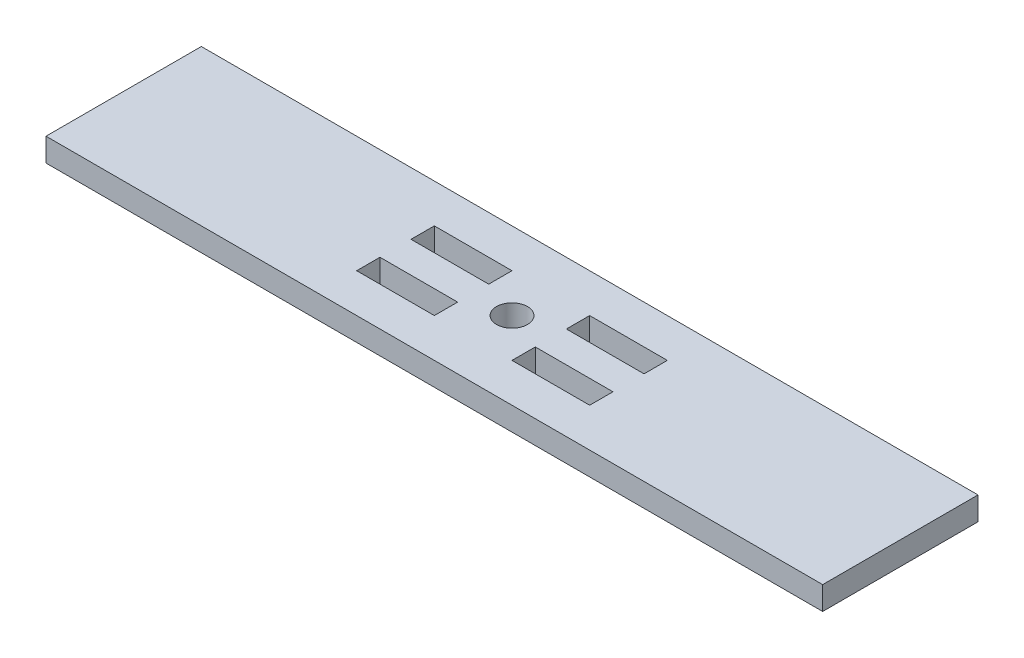
ISO-10303-21;
HEADER;
FILE_DESCRIPTION(('STEP AP214'),'2;1');
FILE_NAME('part.step','',(''),(''),'','','');
FILE_SCHEMA(('AUTOMOTIVE_DESIGN { 1 0 10303 214 1 1 1 1 }'));
ENDSEC;
DATA;
#1=APPLICATION_CONTEXT('core data for automotive mechanical design processes');
#2=APPLICATION_PROTOCOL_DEFINITION('international standard','automotive_design',2000,#1);
#3=PRODUCT_CONTEXT('',#1,'mechanical');
#4=PRODUCT('Part','Part','',(#3));
#5=PRODUCT_RELATED_PRODUCT_CATEGORY('part','',(#4));
#6=PRODUCT_DEFINITION_FORMATION('','',#4);
#7=PRODUCT_DEFINITION_CONTEXT('part definition',#1,'design');
#8=PRODUCT_DEFINITION('design','',#6,#7);
#9=PRODUCT_DEFINITION_SHAPE('','',#8);
#10=(LENGTH_UNIT() NAMED_UNIT(*) SI_UNIT(.MILLI.,.METRE.));
#11=(NAMED_UNIT(*) PLANE_ANGLE_UNIT() SI_UNIT($,.RADIAN.));
#12=(NAMED_UNIT(*) SI_UNIT($,.STERADIAN.) SOLID_ANGLE_UNIT());
#13=UNCERTAINTY_MEASURE_WITH_UNIT(LENGTH_MEASURE(1.E-05),#10,'distance_accuracy_value','');
#14=(GEOMETRIC_REPRESENTATION_CONTEXT(3) GLOBAL_UNCERTAINTY_ASSIGNED_CONTEXT((#13)) GLOBAL_UNIT_ASSIGNED_CONTEXT((#10,
#11,#12)) REPRESENTATION_CONTEXT('',''));
#15=CARTESIAN_POINT('',(0.,0.,0.));
#16=DIRECTION('',(0.,0.,1.));
#17=DIRECTION('',(1.,0.,0.));
#18=AXIS2_PLACEMENT_3D('',#15,#16,#17);
#19=CARTESIAN_POINT('',(-9.82981271411533,1.5,-5.88069373410179));
#20=DIRECTION('',(1.,0.,0.));
#21=DIRECTION('',(0.,0.,-1.));
#22=AXIS2_PLACEMENT_3D('',#19,#20,#21);
#23=PLANE('',#22);
#24=DIRECTION('',(0.,0.,1.));
#25=VECTOR('',#24,1.);
#26=CARTESIAN_POINT('',(-9.82981271411533,0.,-5.88069373410179));
#27=LINE('',#26,#25);
#28=CARTESIAN_POINT('',(-9.82981271411533,0.,-5.88069373410179));
#29=VERTEX_POINT('',#28);
#30=CARTESIAN_POINT('',(-9.82981271411533,0.,4.11930626589821));
#31=VERTEX_POINT('',#30);
#32=EDGE_CURVE('E260',#29,#31,#27,.T.);
#33=ORIENTED_EDGE('',*,*,#32,.T.);
#34=DIRECTION('',(0.,-1.,0.));
#35=VECTOR('',#34,1.);
#36=CARTESIAN_POINT('',(-9.82981271411533,1.5,4.11930626589821));
#37=LINE('',#36,#35);
#38=CARTESIAN_POINT('',(-9.82981271411533,1.5,4.11930626589821));
#39=VERTEX_POINT('',#38);
#40=EDGE_CURVE('E293',#39,#31,#37,.T.);
#41=ORIENTED_EDGE('',*,*,#40,.F.);
#42=DIRECTION('',(0.,0.,1.));
#43=VECTOR('',#42,1.);
#44=CARTESIAN_POINT('',(-9.82981271411533,1.5,-5.88069373410179));
#45=LINE('',#44,#43);
#46=CARTESIAN_POINT('',(-9.82981271411533,1.5,-5.88069373410179));
#47=VERTEX_POINT('',#46);
#48=EDGE_CURVE('E267',#47,#39,#45,.T.);
#49=ORIENTED_EDGE('',*,*,#48,.F.);
#50=DIRECTION('',(0.,-1.,0.));
#51=VECTOR('',#50,1.);
#52=CARTESIAN_POINT('',(-9.82981271411533,1.5,-5.88069373410179));
#53=LINE('',#52,#51);
#54=EDGE_CURVE('E277',#47,#29,#53,.T.);
#55=ORIENTED_EDGE('',*,*,#54,.T.);
#56=EDGE_LOOP('',(#33,#41,#49,#55));
#57=FACE_BOUND('',#56,.T.);
#58=ADVANCED_FACE('F36',(#57),#23,.F.);
#59=CARTESIAN_POINT('',(-9.82981271411533,1.5,4.11930626589821));
#60=DIRECTION('',(0.,0.,-1.));
#61=DIRECTION('',(-1.,0.,0.));
#62=AXIS2_PLACEMENT_3D('',#59,#60,#61);
#63=PLANE('',#62);
#64=DIRECTION('',(1.,0.,0.));
#65=VECTOR('',#64,1.);
#66=CARTESIAN_POINT('',(-9.82981271411533,0.,4.11930626589821));
#67=LINE('',#66,#65);
#68=CARTESIAN_POINT('',(40.1701872858847,0.,4.11930626589821));
#69=VERTEX_POINT('',#68);
#70=EDGE_CURVE('E280',#31,#69,#67,.T.);
#71=ORIENTED_EDGE('',*,*,#70,.T.);
#72=DIRECTION('',(0.,-1.,0.));
#73=VECTOR('',#72,1.);
#74=CARTESIAN_POINT('',(40.1701872858847,1.5,4.11930626589821));
#75=LINE('',#74,#73);
#76=CARTESIAN_POINT('',(40.1701872858847,1.5,4.11930626589821));
#77=VERTEX_POINT('',#76);
#78=EDGE_CURVE('E290',#77,#69,#75,.T.);
#79=ORIENTED_EDGE('',*,*,#78,.F.);
#80=DIRECTION('',(1.,0.,0.));
#81=VECTOR('',#80,1.);
#82=CARTESIAN_POINT('',(-9.82981271411533,1.5,4.11930626589821));
#83=LINE('',#82,#81);
#84=EDGE_CURVE('E270',#39,#77,#83,.T.);
#85=ORIENTED_EDGE('',*,*,#84,.F.);
#86=ORIENTED_EDGE('',*,*,#40,.T.);
#87=EDGE_LOOP('',(#71,#79,#85,#86));
#88=FACE_BOUND('',#87,.T.);
#89=ADVANCED_FACE('F368',(#88),#63,.F.);
#90=CARTESIAN_POINT('',(40.1701872858847,1.5,-5.88069373410179));
#91=DIRECTION('',(-1.,0.,0.));
#92=DIRECTION('',(0.,0.,1.));
#93=AXIS2_PLACEMENT_3D('',#90,#91,#92);
#94=PLANE('',#93);
#95=DIRECTION('',(0.,0.,-1.));
#96=VECTOR('',#95,1.);
#97=CARTESIAN_POINT('',(40.1701872858847,0.,-5.88069373410179));
#98=LINE('',#97,#96);
#99=CARTESIAN_POINT('',(40.1701872858847,0.,-5.88069373410179));
#100=VERTEX_POINT('',#99);
#101=EDGE_CURVE('E282',#69,#100,#98,.T.);
#102=ORIENTED_EDGE('',*,*,#101,.T.);
#103=DIRECTION('',(0.,-1.,0.));
#104=VECTOR('',#103,1.);
#105=CARTESIAN_POINT('',(40.1701872858847,1.5,-5.88069373410179));
#106=LINE('',#105,#104);
#107=CARTESIAN_POINT('',(40.1701872858847,1.5,-5.88069373410179));
#108=VERTEX_POINT('',#107);
#109=EDGE_CURVE('E287',#108,#100,#106,.T.);
#110=ORIENTED_EDGE('',*,*,#109,.F.);
#111=DIRECTION('',(0.,0.,-1.));
#112=VECTOR('',#111,1.);
#113=CARTESIAN_POINT('',(40.1701872858847,1.5,-5.88069373410179));
#114=LINE('',#113,#112);
#115=EDGE_CURVE('E273',#77,#108,#114,.T.);
#116=ORIENTED_EDGE('',*,*,#115,.F.);
#117=ORIENTED_EDGE('',*,*,#78,.T.);
#118=EDGE_LOOP('',(#102,#110,#116,#117));
#119=FACE_BOUND('',#118,.T.);
#120=ADVANCED_FACE('F373',(#119),#94,.F.);
#121=CARTESIAN_POINT('',(-9.82981271411533,1.5,-5.88069373410179));
#122=DIRECTION('',(0.,0.,1.));
#123=DIRECTION('',(1.,0.,0.));
#124=AXIS2_PLACEMENT_3D('',#121,#122,#123);
#125=PLANE('',#124);
#126=DIRECTION('',(-1.,0.,0.));
#127=VECTOR('',#126,1.);
#128=CARTESIAN_POINT('',(-9.82981271411533,0.,-5.88069373410179));
#129=LINE('',#128,#127);
#130=EDGE_CURVE('E271',#100,#29,#129,.T.);
#131=ORIENTED_EDGE('',*,*,#130,.T.);
#132=ORIENTED_EDGE('',*,*,#54,.F.);
#133=DIRECTION('',(-1.,0.,0.));
#134=VECTOR('',#133,1.);
#135=CARTESIAN_POINT('',(-9.82981271411533,1.5,-5.88069373410179));
#136=LINE('',#135,#134);
#137=EDGE_CURVE('E275',#108,#47,#136,.T.);
#138=ORIENTED_EDGE('',*,*,#137,.F.);
#139=ORIENTED_EDGE('',*,*,#109,.T.);
#140=EDGE_LOOP('',(#131,#132,#138,#139));
#141=FACE_BOUND('',#140,.T.);
#142=ADVANCED_FACE('F388',(#141),#125,.F.);
#143=CARTESIAN_POINT('',(0.,1.5,0.));
#144=DIRECTION('',(0.,1.,0.));
#145=DIRECTION('',(0.,0.,1.));
#146=AXIS2_PLACEMENT_3D('',#143,#144,#145);
#147=PLANE('',#146);
#148=CARTESIAN_POINT('',(15.1701872858847,1.5,-0.880693734101789));
#149=DIRECTION('',(0.,1.,0.));
#150=DIRECTION('',(0.,0.,1.));
#151=AXIS2_PLACEMENT_3D('',#148,#149,#150);
#152=CIRCLE('',#151,0.999999999999998);
#153=CARTESIAN_POINT('',(15.1701872858847,1.5,0.119306265898209));
#154=VERTEX_POINT('',#153);
#155=EDGE_CURVE('E548',#154,#154,#152,.T.);
#156=ORIENTED_EDGE('',*,*,#155,.F.);
#157=EDGE_LOOP('',(#156));
#158=FACE_BOUND('',#157,.T.);
#159=DIRECTION('',(0.,0.,-1.));
#160=VECTOR('',#159,1.);
#161=CARTESIAN_POINT('',(12.6701872858847,1.5,1.61930626589821));
#162=LINE('',#161,#160);
#163=CARTESIAN_POINT('',(12.6701872858847,1.5,1.61930626589821));
#164=VERTEX_POINT('',#163);
#165=CARTESIAN_POINT('',(12.6701872858847,1.5,0.119306265898214));
#166=VERTEX_POINT('',#165);
#167=EDGE_CURVE('E51',#164,#166,#162,.T.);
#168=ORIENTED_EDGE('',*,*,#167,.F.);
#169=DIRECTION('',(1.,0.,0.));
#170=VECTOR('',#169,1.);
#171=CARTESIAN_POINT('',(12.6701872858847,1.5,1.61930626589821));
#172=LINE('',#171,#170);
#173=CARTESIAN_POINT('',(7.67018728588467,1.5,1.61930626589821));
#174=VERTEX_POINT('',#173);
#175=EDGE_CURVE('E237',#174,#164,#172,.T.);
#176=ORIENTED_EDGE('',*,*,#175,.F.);
#177=DIRECTION('',(0.,0.,1.));
#178=VECTOR('',#177,1.);
#179=CARTESIAN_POINT('',(7.67018728588467,1.5,1.61930626589821));
#180=LINE('',#179,#178);
#181=CARTESIAN_POINT('',(7.67018728588467,1.5,0.119306265898214));
#182=VERTEX_POINT('',#181);
#183=EDGE_CURVE('E234',#182,#174,#180,.T.);
#184=ORIENTED_EDGE('',*,*,#183,.F.);
#185=DIRECTION('',(-1.,0.,0.));
#186=VECTOR('',#185,1.);
#187=CARTESIAN_POINT('',(12.6701872858847,1.5,0.119306265898214));
#188=LINE('',#187,#186);
#189=EDGE_CURVE('E231',#166,#182,#188,.T.);
#190=ORIENTED_EDGE('',*,*,#189,.F.);
#191=EDGE_LOOP('',(#168,#176,#184,#190));
#192=FACE_BOUND('',#191,.T.);
#193=DIRECTION('',(0.,0.,-1.));
#194=VECTOR('',#193,1.);
#195=CARTESIAN_POINT('',(22.6701872858847,1.5,1.61930626589821));
#196=LINE('',#195,#194);
#197=CARTESIAN_POINT('',(22.6701872858847,1.5,1.61930626589821));
#198=VERTEX_POINT('',#197);
#199=CARTESIAN_POINT('',(22.6701872858847,1.5,0.119306265898213));
#200=VERTEX_POINT('',#199);
#201=EDGE_CURVE('E59',#198,#200,#196,.T.);
#202=ORIENTED_EDGE('',*,*,#201,.F.);
#203=DIRECTION('',(1.,0.,0.));
#204=VECTOR('',#203,1.);
#205=CARTESIAN_POINT('',(22.6701872858847,1.5,1.61930626589821));
#206=LINE('',#205,#204);
#207=CARTESIAN_POINT('',(17.6701872858847,1.5,1.61930626589821));
#208=VERTEX_POINT('',#207);
#209=EDGE_CURVE('E219',#208,#198,#206,.T.);
#210=ORIENTED_EDGE('',*,*,#209,.F.);
#211=DIRECTION('',(0.,0.,1.));
#212=VECTOR('',#211,1.);
#213=CARTESIAN_POINT('',(17.6701872858847,1.5,1.61930626589821));
#214=LINE('',#213,#212);
#215=CARTESIAN_POINT('',(17.6701872858847,1.5,0.119306265898213));
#216=VERTEX_POINT('',#215);
#217=EDGE_CURVE('E216',#216,#208,#214,.T.);
#218=ORIENTED_EDGE('',*,*,#217,.F.);
#219=DIRECTION('',(-1.,0.,0.));
#220=VECTOR('',#219,1.);
#221=CARTESIAN_POINT('',(22.6701872858847,1.5,0.119306265898213));
#222=LINE('',#221,#220);
#223=EDGE_CURVE('E212',#200,#216,#222,.T.);
#224=ORIENTED_EDGE('',*,*,#223,.F.);
#225=EDGE_LOOP('',(#202,#210,#218,#224));
#226=FACE_BOUND('',#225,.T.);
#227=DIRECTION('',(0.,0.,1.));
#228=VECTOR('',#227,1.);
#229=CARTESIAN_POINT('',(17.6701872858847,1.5,-1.88069373410179));
#230=LINE('',#229,#228);
#231=CARTESIAN_POINT('',(17.6701872858847,1.5,-3.38069373410179));
#232=VERTEX_POINT('',#231);
#233=CARTESIAN_POINT('',(17.6701872858847,1.5,-1.88069373410179));
#234=VERTEX_POINT('',#233);
#235=EDGE_CURVE('E196',#232,#234,#230,.T.);
#236=ORIENTED_EDGE('',*,*,#235,.F.);
#237=DIRECTION('',(-1.,0.,0.));
#238=VECTOR('',#237,1.);
#239=CARTESIAN_POINT('',(17.6701872858847,1.5,-3.38069373410179));
#240=LINE('',#239,#238);
#241=CARTESIAN_POINT('',(22.6701872858847,1.5,-3.3806937341018));
#242=VERTEX_POINT('',#241);
#243=EDGE_CURVE('E201',#242,#232,#240,.T.);
#244=ORIENTED_EDGE('',*,*,#243,.F.);
#245=DIRECTION('',(0.,0.,-1.));
#246=VECTOR('',#245,1.);
#247=CARTESIAN_POINT('',(22.6701872858847,1.5,-1.88069373410179));
#248=LINE('',#247,#246);
#249=CARTESIAN_POINT('',(22.6701872858847,1.5,-1.88069373410179));
#250=VERTEX_POINT('',#249);
#251=EDGE_CURVE('E180',#250,#242,#248,.T.);
#252=ORIENTED_EDGE('',*,*,#251,.F.);
#253=DIRECTION('',(1.,0.,0.));
#254=VECTOR('',#253,1.);
#255=CARTESIAN_POINT('',(17.6701872858847,1.5,-1.88069373410179));
#256=LINE('',#255,#254);
#257=EDGE_CURVE('E191',#234,#250,#256,.T.);
#258=ORIENTED_EDGE('',*,*,#257,.F.);
#259=EDGE_LOOP('',(#236,#244,#252,#258));
#260=FACE_BOUND('',#259,.T.);
#261=DIRECTION('',(0.,0.,1.));
#262=VECTOR('',#261,1.);
#263=CARTESIAN_POINT('',(7.67018728588467,1.5,-3.38069373410179));
#264=LINE('',#263,#262);
#265=CARTESIAN_POINT('',(7.67018728588467,1.5,-3.38069373410179));
#266=VERTEX_POINT('',#265);
#267=CARTESIAN_POINT('',(7.67018728588467,1.5,-1.88069373410179));
#268=VERTEX_POINT('',#267);
#269=EDGE_CURVE('E208',#266,#268,#264,.T.);
#270=ORIENTED_EDGE('',*,*,#269,.F.);
#271=DIRECTION('',(-1.,0.,0.));
#272=VECTOR('',#271,1.);
#273=CARTESIAN_POINT('',(7.67018728588467,1.5,-3.38069373410179));
#274=LINE('',#273,#272);
#275=CARTESIAN_POINT('',(12.6701872858847,1.5,-3.38069373410179));
#276=VERTEX_POINT('',#275);
#277=EDGE_CURVE('E254',#276,#266,#274,.T.);
#278=ORIENTED_EDGE('',*,*,#277,.F.);
#279=DIRECTION('',(0.,0.,-1.));
#280=VECTOR('',#279,1.);
#281=CARTESIAN_POINT('',(12.6701872858847,1.5,-3.38069373410179));
#282=LINE('',#281,#280);
#283=CARTESIAN_POINT('',(12.6701872858847,1.5,-1.88069373410179));
#284=VERTEX_POINT('',#283);
#285=EDGE_CURVE('E251',#284,#276,#282,.T.);
#286=ORIENTED_EDGE('',*,*,#285,.F.);
#287=DIRECTION('',(1.,0.,0.));
#288=VECTOR('',#287,1.);
#289=CARTESIAN_POINT('',(7.67018728588467,1.5,-1.88069373410179));
#290=LINE('',#289,#288);
#291=EDGE_CURVE('E248',#268,#284,#290,.T.);
#292=ORIENTED_EDGE('',*,*,#291,.F.);
#293=EDGE_LOOP('',(#270,#278,#286,#292));
#294=FACE_BOUND('',#293,.T.);
#295=ORIENTED_EDGE('',*,*,#48,.T.);
#296=ORIENTED_EDGE('',*,*,#84,.T.);
#297=ORIENTED_EDGE('',*,*,#115,.T.);
#298=ORIENTED_EDGE('',*,*,#137,.T.);
#299=EDGE_LOOP('',(#295,#296,#297,#298));
#300=FACE_BOUND('',#299,.T.);
#301=ADVANCED_FACE('F198',(#158,#192,#226,#260,#294,#300),#147,.T.);
#302=CARTESIAN_POINT('',(0.,0.,0.));
#303=DIRECTION('',(0.,1.,0.));
#304=DIRECTION('',(0.,0.,1.));
#305=AXIS2_PLACEMENT_3D('',#302,#303,#304);
#306=PLANE('',#305);
#307=CARTESIAN_POINT('',(15.1701872858847,0.,-0.880693734101789));
#308=DIRECTION('',(0.,1.,0.));
#309=DIRECTION('',(0.,0.,1.));
#310=AXIS2_PLACEMENT_3D('',#307,#308,#309);
#311=CIRCLE('',#310,0.999999999999998);
#312=CARTESIAN_POINT('',(15.1701872858847,0.,0.119306265898209));
#313=VERTEX_POINT('',#312);
#314=EDGE_CURVE('E39',#313,#313,#311,.T.);
#315=ORIENTED_EDGE('',*,*,#314,.T.);
#316=EDGE_LOOP('',(#315));
#317=FACE_BOUND('',#316,.T.);
#318=DIRECTION('',(1.,0.,0.));
#319=VECTOR('',#318,1.);
#320=CARTESIAN_POINT('',(0.,0.,1.61930626589821));
#321=LINE('',#320,#319);
#322=CARTESIAN_POINT('',(7.67018728588467,0.,1.61930626589821));
#323=VERTEX_POINT('',#322);
#324=CARTESIAN_POINT('',(12.6701872858847,0.,1.61930626589821));
#325=VERTEX_POINT('',#324);
#326=EDGE_CURVE('E44',#323,#325,#321,.T.);
#327=ORIENTED_EDGE('',*,*,#326,.T.);
#328=DIRECTION('',(0.,0.,-1.));
#329=VECTOR('',#328,1.);
#330=CARTESIAN_POINT('',(12.6701872858847,0.,0.));
#331=LINE('',#330,#329);
#332=CARTESIAN_POINT('',(12.6701872858847,0.,0.119306265898214));
#333=VERTEX_POINT('',#332);
#334=EDGE_CURVE('E11',#325,#333,#331,.T.);
#335=ORIENTED_EDGE('',*,*,#334,.T.);
#336=DIRECTION('',(-1.,0.,0.));
#337=VECTOR('',#336,1.);
#338=CARTESIAN_POINT('',(0.,0.,0.119306265898215));
#339=LINE('',#338,#337);
#340=CARTESIAN_POINT('',(7.67018728588467,0.,0.119306265898214));
#341=VERTEX_POINT('',#340);
#342=EDGE_CURVE('E329',#333,#341,#339,.T.);
#343=ORIENTED_EDGE('',*,*,#342,.T.);
#344=DIRECTION('',(0.,0.,1.));
#345=VECTOR('',#344,1.);
#346=CARTESIAN_POINT('',(7.67018728588467,0.,0.));
#347=LINE('',#346,#345);
#348=EDGE_CURVE('E332',#341,#323,#347,.T.);
#349=ORIENTED_EDGE('',*,*,#348,.T.);
#350=EDGE_LOOP('',(#327,#335,#343,#349));
#351=FACE_BOUND('',#350,.T.);
#352=DIRECTION('',(1.,0.,0.));
#353=VECTOR('',#352,1.);
#354=CARTESIAN_POINT('',(0.,0.,1.61930626589821));
#355=LINE('',#354,#353);
#356=CARTESIAN_POINT('',(17.6701872858847,0.,1.61930626589821));
#357=VERTEX_POINT('',#356);
#358=CARTESIAN_POINT('',(22.6701872858847,0.,1.61930626589821));
#359=VERTEX_POINT('',#358);
#360=EDGE_CURVE('E323',#357,#359,#355,.T.);
#361=ORIENTED_EDGE('',*,*,#360,.T.);
#362=DIRECTION('',(0.,0.,-1.));
#363=VECTOR('',#362,1.);
#364=CARTESIAN_POINT('',(22.6701872858847,0.,-1.0487068290564E-13));
#365=LINE('',#364,#363);
#366=CARTESIAN_POINT('',(22.6701872858847,0.,0.119306265898213));
#367=VERTEX_POINT('',#366);
#368=EDGE_CURVE('E326',#359,#367,#365,.T.);
#369=ORIENTED_EDGE('',*,*,#368,.T.);
#370=DIRECTION('',(-1.,0.,0.));
#371=VECTOR('',#370,1.);
#372=CARTESIAN_POINT('',(0.,0.,0.119306265898216));
#373=LINE('',#372,#371);
#374=CARTESIAN_POINT('',(17.6701872858847,0.,0.119306265898213));
#375=VERTEX_POINT('',#374);
#376=EDGE_CURVE('E317',#367,#375,#373,.T.);
#377=ORIENTED_EDGE('',*,*,#376,.T.);
#378=DIRECTION('',(0.,0.,1.));
#379=VECTOR('',#378,1.);
#380=CARTESIAN_POINT('',(17.6701872858847,0.,0.));
#381=LINE('',#380,#379);
#382=EDGE_CURVE('E320',#375,#357,#381,.T.);
#383=ORIENTED_EDGE('',*,*,#382,.T.);
#384=EDGE_LOOP('',(#361,#369,#377,#383));
#385=FACE_BOUND('',#384,.T.);
#386=DIRECTION('',(-1.,0.,0.));
#387=VECTOR('',#386,1.);
#388=CARTESIAN_POINT('',(0.,0.,-3.38069373410178));
#389=LINE('',#388,#387);
#390=CARTESIAN_POINT('',(22.6701872858847,0.,-3.3806937341018));
#391=VERTEX_POINT('',#390);
#392=CARTESIAN_POINT('',(17.6701872858847,0.,-3.38069373410179));
#393=VERTEX_POINT('',#392);
#394=EDGE_CURVE('E311',#391,#393,#389,.T.);
#395=ORIENTED_EDGE('',*,*,#394,.T.);
#396=DIRECTION('',(0.,0.,1.));
#397=VECTOR('',#396,1.);
#398=CARTESIAN_POINT('',(17.6701872858847,0.,0.));
#399=LINE('',#398,#397);
#400=CARTESIAN_POINT('',(17.6701872858847,0.,-1.88069373410179));
#401=VERTEX_POINT('',#400);
#402=EDGE_CURVE('E314',#393,#401,#399,.T.);
#403=ORIENTED_EDGE('',*,*,#402,.T.);
#404=DIRECTION('',(1.,0.,0.));
#405=VECTOR('',#404,1.);
#406=CARTESIAN_POINT('',(0.,0.,-1.88069373410179));
#407=LINE('',#406,#405);
#408=CARTESIAN_POINT('',(22.6701872858847,0.,-1.88069373410179));
#409=VERTEX_POINT('',#408);
#410=EDGE_CURVE('E308',#401,#409,#407,.T.);
#411=ORIENTED_EDGE('',*,*,#410,.T.);
#412=DIRECTION('',(0.,0.,-1.));
#413=VECTOR('',#412,1.);
#414=CARTESIAN_POINT('',(22.6701872858847,0.,1.0487068290564E-13));
#415=LINE('',#414,#413);
#416=EDGE_CURVE('E183',#409,#391,#415,.T.);
#417=ORIENTED_EDGE('',*,*,#416,.T.);
#418=EDGE_LOOP('',(#395,#403,#411,#417));
#419=FACE_BOUND('',#418,.T.);
#420=DIRECTION('',(-1.,0.,0.));
#421=VECTOR('',#420,1.);
#422=CARTESIAN_POINT('',(0.,0.,-3.38069373410179));
#423=LINE('',#422,#421);
#424=CARTESIAN_POINT('',(12.6701872858847,0.,-3.38069373410179));
#425=VERTEX_POINT('',#424);
#426=CARTESIAN_POINT('',(7.67018728588467,0.,-3.38069373410179));
#427=VERTEX_POINT('',#426);
#428=EDGE_CURVE('E302',#425,#427,#423,.T.);
#429=ORIENTED_EDGE('',*,*,#428,.T.);
#430=DIRECTION('',(0.,0.,1.));
#431=VECTOR('',#430,1.);
#432=CARTESIAN_POINT('',(7.67018728588466,0.,0.));
#433=LINE('',#432,#431);
#434=CARTESIAN_POINT('',(7.67018728588467,0.,-1.88069373410179));
#435=VERTEX_POINT('',#434);
#436=EDGE_CURVE('E305',#427,#435,#433,.T.);
#437=ORIENTED_EDGE('',*,*,#436,.T.);
#438=DIRECTION('',(1.,0.,0.));
#439=VECTOR('',#438,1.);
#440=CARTESIAN_POINT('',(0.,0.,-1.88069373410179));
#441=LINE('',#440,#439);
#442=CARTESIAN_POINT('',(12.6701872858847,0.,-1.88069373410179));
#443=VERTEX_POINT('',#442);
#444=EDGE_CURVE('E296',#435,#443,#441,.T.);
#445=ORIENTED_EDGE('',*,*,#444,.T.);
#446=DIRECTION('',(0.,0.,-1.));
#447=VECTOR('',#446,1.);
#448=CARTESIAN_POINT('',(12.6701872858847,0.,0.));
#449=LINE('',#448,#447);
#450=EDGE_CURVE('E299',#443,#425,#449,.T.);
#451=ORIENTED_EDGE('',*,*,#450,.T.);
#452=EDGE_LOOP('',(#429,#437,#445,#451));
#453=FACE_BOUND('',#452,.T.);
#454=ORIENTED_EDGE('',*,*,#32,.F.);
#455=ORIENTED_EDGE('',*,*,#130,.F.);
#456=ORIENTED_EDGE('',*,*,#101,.F.);
#457=ORIENTED_EDGE('',*,*,#70,.F.);
#458=EDGE_LOOP('',(#454,#455,#456,#457));
#459=FACE_BOUND('',#458,.T.);
#460=ADVANCED_FACE('F337',(#317,#351,#385,#419,#453,#459),#306,.F.);
#461=CARTESIAN_POINT('',(7.67018728588467,-0.5,-3.38069373410179));
#462=DIRECTION('',(-1.,0.,0.));
#463=DIRECTION('',(0.,0.,1.));
#464=AXIS2_PLACEMENT_3D('',#461,#462,#463);
#465=PLANE('',#464);
#466=DIRECTION('',(0.,1.,0.));
#467=VECTOR('',#466,1.);
#468=CARTESIAN_POINT('',(7.67018728588467,-0.5,-3.38069373410179));
#469=LINE('',#468,#467);
#470=EDGE_CURVE('E258',#427,#266,#469,.T.);
#471=ORIENTED_EDGE('',*,*,#470,.T.);
#472=ORIENTED_EDGE('',*,*,#269,.T.);
#473=DIRECTION('',(0.,1.,0.));
#474=VECTOR('',#473,1.);
#475=CARTESIAN_POINT('',(7.67018728588467,-0.5,-1.88069373410179));
#476=LINE('',#475,#474);
#477=EDGE_CURVE('E257',#435,#268,#476,.T.);
#478=ORIENTED_EDGE('',*,*,#477,.F.);
#479=ORIENTED_EDGE('',*,*,#436,.F.);
#480=EDGE_LOOP('',(#471,#472,#478,#479));
#481=FACE_BOUND('',#480,.T.);
#482=ADVANCED_FACE('F399',(#481),#465,.F.);
#483=CARTESIAN_POINT('',(7.67018728588467,-0.5,-3.38069373410179));
#484=DIRECTION('',(0.,0.,-1.));
#485=DIRECTION('',(-1.,0.,0.));
#486=AXIS2_PLACEMENT_3D('',#483,#484,#485);
#487=PLANE('',#486);
#488=DIRECTION('',(0.,1.,0.));
#489=VECTOR('',#488,1.);
#490=CARTESIAN_POINT('',(12.6701872858847,-0.5,-3.38069373410179));
#491=LINE('',#490,#489);
#492=EDGE_CURVE('E261',#425,#276,#491,.T.);
#493=ORIENTED_EDGE('',*,*,#492,.T.);
#494=ORIENTED_EDGE('',*,*,#277,.T.);
#495=ORIENTED_EDGE('',*,*,#470,.F.);
#496=ORIENTED_EDGE('',*,*,#428,.F.);
#497=EDGE_LOOP('',(#493,#494,#495,#496));
#498=FACE_BOUND('',#497,.T.);
#499=ADVANCED_FACE('F406',(#498),#487,.F.);
#500=CARTESIAN_POINT('',(12.6701872858847,-0.5,-3.38069373410179));
#501=DIRECTION('',(1.,0.,0.));
#502=DIRECTION('',(0.,0.,-1.));
#503=AXIS2_PLACEMENT_3D('',#500,#501,#502);
#504=PLANE('',#503);
#505=DIRECTION('',(0.,1.,0.));
#506=VECTOR('',#505,1.);
#507=CARTESIAN_POINT('',(12.6701872858847,-0.5,-1.88069373410179));
#508=LINE('',#507,#506);
#509=EDGE_CURVE('E263',#443,#284,#508,.T.);
#510=ORIENTED_EDGE('',*,*,#509,.T.);
#511=ORIENTED_EDGE('',*,*,#285,.T.);
#512=ORIENTED_EDGE('',*,*,#492,.F.);
#513=ORIENTED_EDGE('',*,*,#450,.F.);
#514=EDGE_LOOP('',(#510,#511,#512,#513));
#515=FACE_BOUND('',#514,.T.);
#516=ADVANCED_FACE('F412',(#515),#504,.F.);
#517=CARTESIAN_POINT('',(7.67018728588467,-0.5,-1.88069373410179));
#518=DIRECTION('',(0.,0.,1.));
#519=DIRECTION('',(1.,0.,0.));
#520=AXIS2_PLACEMENT_3D('',#517,#518,#519);
#521=PLANE('',#520);
#522=ORIENTED_EDGE('',*,*,#477,.T.);
#523=ORIENTED_EDGE('',*,*,#291,.T.);
#524=ORIENTED_EDGE('',*,*,#509,.F.);
#525=ORIENTED_EDGE('',*,*,#444,.F.);
#526=EDGE_LOOP('',(#522,#523,#524,#525));
#527=FACE_BOUND('',#526,.T.);
#528=ADVANCED_FACE('F408',(#527),#521,.F.);
#529=CARTESIAN_POINT('',(17.6701872858847,-0.5,-1.88069373410179));
#530=DIRECTION('',(-1.,0.,0.));
#531=DIRECTION('',(0.,0.,1.));
#532=AXIS2_PLACEMENT_3D('',#529,#530,#531);
#533=PLANE('',#532);
#534=DIRECTION('',(0.,1.,0.));
#535=VECTOR('',#534,1.);
#536=CARTESIAN_POINT('',(17.6701872858847,-0.5,-3.38069373410179));
#537=LINE('',#536,#535);
#538=EDGE_CURVE('E206',#393,#232,#537,.T.);
#539=ORIENTED_EDGE('',*,*,#538,.T.);
#540=ORIENTED_EDGE('',*,*,#235,.T.);
#541=DIRECTION('',(0.,1.,0.));
#542=VECTOR('',#541,1.);
#543=CARTESIAN_POINT('',(17.6701872858847,-0.5,-1.88069373410179));
#544=LINE('',#543,#542);
#545=EDGE_CURVE('E187',#401,#234,#544,.T.);
#546=ORIENTED_EDGE('',*,*,#545,.F.);
#547=ORIENTED_EDGE('',*,*,#402,.F.);
#548=EDGE_LOOP('',(#539,#540,#546,#547));
#549=FACE_BOUND('',#548,.T.);
#550=ADVANCED_FACE('F411',(#549),#533,.F.);
#551=CARTESIAN_POINT('',(17.6701872858847,-0.5,-3.38069373410179));
#552=DIRECTION('',(0.,0.,-1.));
#553=DIRECTION('',(-1.,0.,0.));
#554=AXIS2_PLACEMENT_3D('',#551,#552,#553);
#555=PLANE('',#554);
#556=DIRECTION('',(0.,1.,0.));
#557=VECTOR('',#556,1.);
#558=CARTESIAN_POINT('',(22.6701872858847,-0.5,-3.3806937341018));
#559=LINE('',#558,#557);
#560=EDGE_CURVE('E186',#391,#242,#559,.T.);
#561=ORIENTED_EDGE('',*,*,#560,.T.);
#562=ORIENTED_EDGE('',*,*,#243,.T.);
#563=ORIENTED_EDGE('',*,*,#538,.F.);
#564=ORIENTED_EDGE('',*,*,#394,.F.);
#565=EDGE_LOOP('',(#561,#562,#563,#564));
#566=FACE_BOUND('',#565,.T.);
#567=ADVANCED_FACE('F445',(#566),#555,.F.);
#568=CARTESIAN_POINT('',(22.6701872858847,-0.5,-1.88069373410179));
#569=DIRECTION('',(1.,0.,0.));
#570=DIRECTION('',(0.,0.,-1.));
#571=AXIS2_PLACEMENT_3D('',#568,#569,#570);
#572=PLANE('',#571);
#573=DIRECTION('',(0.,1.,0.));
#574=VECTOR('',#573,1.);
#575=CARTESIAN_POINT('',(22.6701872858847,-0.5,-1.88069373410179));
#576=LINE('',#575,#574);
#577=EDGE_CURVE('E175',#409,#250,#576,.T.);
#578=ORIENTED_EDGE('',*,*,#577,.T.);
#579=ORIENTED_EDGE('',*,*,#251,.T.);
#580=ORIENTED_EDGE('',*,*,#560,.F.);
#581=ORIENTED_EDGE('',*,*,#416,.F.);
#582=EDGE_LOOP('',(#578,#579,#580,#581));
#583=FACE_BOUND('',#582,.T.);
#584=ADVANCED_FACE('F177',(#583),#572,.F.);
#585=CARTESIAN_POINT('',(17.6701872858847,-0.5,-1.88069373410179));
#586=DIRECTION('',(0.,0.,1.));
#587=DIRECTION('',(1.,0.,0.));
#588=AXIS2_PLACEMENT_3D('',#585,#586,#587);
#589=PLANE('',#588);
#590=ORIENTED_EDGE('',*,*,#545,.T.);
#591=ORIENTED_EDGE('',*,*,#257,.T.);
#592=ORIENTED_EDGE('',*,*,#577,.F.);
#593=ORIENTED_EDGE('',*,*,#410,.F.);
#594=EDGE_LOOP('',(#590,#591,#592,#593));
#595=FACE_BOUND('',#594,.T.);
#596=ADVANCED_FACE('F192',(#595),#589,.F.);
#597=CARTESIAN_POINT('',(22.6701872858847,-0.5,1.61930626589821));
#598=DIRECTION('',(1.,0.,0.));
#599=DIRECTION('',(0.,0.,-1.));
#600=AXIS2_PLACEMENT_3D('',#597,#598,#599);
#601=PLANE('',#600);
#602=DIRECTION('',(0.,1.,0.));
#603=VECTOR('',#602,1.);
#604=CARTESIAN_POINT('',(22.6701872858847,-0.5,1.61930626589821));
#605=LINE('',#604,#603);
#606=EDGE_CURVE('E223',#359,#198,#605,.T.);
#607=ORIENTED_EDGE('',*,*,#606,.T.);
#608=ORIENTED_EDGE('',*,*,#201,.T.);
#609=DIRECTION('',(0.,1.,0.));
#610=VECTOR('',#609,1.);
#611=CARTESIAN_POINT('',(22.6701872858847,-0.5,0.119306265898213));
#612=LINE('',#611,#610);
#613=EDGE_CURVE('E222',#367,#200,#612,.T.);
#614=ORIENTED_EDGE('',*,*,#613,.F.);
#615=ORIENTED_EDGE('',*,*,#368,.F.);
#616=EDGE_LOOP('',(#607,#608,#614,#615));
#617=FACE_BOUND('',#616,.T.);
#618=ADVANCED_FACE('F466',(#617),#601,.F.);
#619=CARTESIAN_POINT('',(22.6701872858847,-0.5,1.61930626589821));
#620=DIRECTION('',(0.,0.,1.));
#621=DIRECTION('',(1.,0.,0.));
#622=AXIS2_PLACEMENT_3D('',#619,#620,#621);
#623=PLANE('',#622);
#624=DIRECTION('',(0.,1.,0.));
#625=VECTOR('',#624,1.);
#626=CARTESIAN_POINT('',(17.6701872858847,-0.5,1.61930626589821));
#627=LINE('',#626,#625);
#628=EDGE_CURVE('E225',#357,#208,#627,.T.);
#629=ORIENTED_EDGE('',*,*,#628,.T.);
#630=ORIENTED_EDGE('',*,*,#209,.T.);
#631=ORIENTED_EDGE('',*,*,#606,.F.);
#632=ORIENTED_EDGE('',*,*,#360,.F.);
#633=EDGE_LOOP('',(#629,#630,#631,#632));
#634=FACE_BOUND('',#633,.T.);
#635=ADVANCED_FACE('F473',(#634),#623,.F.);
#636=CARTESIAN_POINT('',(17.6701872858847,-0.5,1.61930626589821));
#637=DIRECTION('',(-1.,0.,0.));
#638=DIRECTION('',(0.,0.,1.));
#639=AXIS2_PLACEMENT_3D('',#636,#637,#638);
#640=PLANE('',#639);
#641=DIRECTION('',(0.,1.,0.));
#642=VECTOR('',#641,1.);
#643=CARTESIAN_POINT('',(17.6701872858847,-0.5,0.119306265898213));
#644=LINE('',#643,#642);
#645=EDGE_CURVE('E227',#375,#216,#644,.T.);
#646=ORIENTED_EDGE('',*,*,#645,.T.);
#647=ORIENTED_EDGE('',*,*,#217,.T.);
#648=ORIENTED_EDGE('',*,*,#628,.F.);
#649=ORIENTED_EDGE('',*,*,#382,.F.);
#650=EDGE_LOOP('',(#646,#647,#648,#649));
#651=FACE_BOUND('',#650,.T.);
#652=ADVANCED_FACE('F362',(#651),#640,.F.);
#653=CARTESIAN_POINT('',(22.6701872858847,-0.5,0.119306265898213));
#654=DIRECTION('',(0.,0.,-1.));
#655=DIRECTION('',(-1.,0.,0.));
#656=AXIS2_PLACEMENT_3D('',#653,#654,#655);
#657=PLANE('',#656);
#658=ORIENTED_EDGE('',*,*,#613,.T.);
#659=ORIENTED_EDGE('',*,*,#223,.T.);
#660=ORIENTED_EDGE('',*,*,#645,.F.);
#661=ORIENTED_EDGE('',*,*,#376,.F.);
#662=EDGE_LOOP('',(#658,#659,#660,#661));
#663=FACE_BOUND('',#662,.T.);
#664=ADVANCED_FACE('F355',(#663),#657,.F.);
#665=CARTESIAN_POINT('',(12.6701872858847,-0.5,1.61930626589821));
#666=DIRECTION('',(1.,0.,0.));
#667=DIRECTION('',(0.,0.,-1.));
#668=AXIS2_PLACEMENT_3D('',#665,#666,#667);
#669=PLANE('',#668);
#670=DIRECTION('',(0.,1.,0.));
#671=VECTOR('',#670,1.);
#672=CARTESIAN_POINT('',(12.6701872858847,-0.5,1.61930626589821));
#673=LINE('',#672,#671);
#674=EDGE_CURVE('E213',#325,#164,#673,.T.);
#675=ORIENTED_EDGE('',*,*,#674,.T.);
#676=ORIENTED_EDGE('',*,*,#167,.T.);
#677=DIRECTION('',(0.,1.,0.));
#678=VECTOR('',#677,1.);
#679=CARTESIAN_POINT('',(12.6701872858847,-0.5,0.119306265898214));
#680=LINE('',#679,#678);
#681=EDGE_CURVE('E240',#333,#166,#680,.T.);
#682=ORIENTED_EDGE('',*,*,#681,.F.);
#683=ORIENTED_EDGE('',*,*,#334,.F.);
#684=EDGE_LOOP('',(#675,#676,#682,#683));
#685=FACE_BOUND('',#684,.T.);
#686=ADVANCED_FACE('F353',(#685),#669,.F.);
#687=CARTESIAN_POINT('',(12.6701872858847,-0.5,1.61930626589821));
#688=DIRECTION('',(0.,0.,1.));
#689=DIRECTION('',(1.,0.,0.));
#690=AXIS2_PLACEMENT_3D('',#687,#688,#689);
#691=PLANE('',#690);
#692=DIRECTION('',(0.,1.,0.));
#693=VECTOR('',#692,1.);
#694=CARTESIAN_POINT('',(7.67018728588467,-0.5,1.61930626589821));
#695=LINE('',#694,#693);
#696=EDGE_CURVE('E242',#323,#174,#695,.T.);
#697=ORIENTED_EDGE('',*,*,#696,.T.);
#698=ORIENTED_EDGE('',*,*,#175,.T.);
#699=ORIENTED_EDGE('',*,*,#674,.F.);
#700=ORIENTED_EDGE('',*,*,#326,.F.);
#701=EDGE_LOOP('',(#697,#698,#699,#700));
#702=FACE_BOUND('',#701,.T.);
#703=ADVANCED_FACE('F343',(#702),#691,.F.);
#704=CARTESIAN_POINT('',(7.67018728588467,-0.5,1.61930626589821));
#705=DIRECTION('',(-1.,0.,0.));
#706=DIRECTION('',(0.,0.,1.));
#707=AXIS2_PLACEMENT_3D('',#704,#705,#706);
#708=PLANE('',#707);
#709=DIRECTION('',(0.,1.,0.));
#710=VECTOR('',#709,1.);
#711=CARTESIAN_POINT('',(7.67018728588467,-0.5,0.119306265898214));
#712=LINE('',#711,#710);
#713=EDGE_CURVE('E244',#341,#182,#712,.T.);
#714=ORIENTED_EDGE('',*,*,#713,.T.);
#715=ORIENTED_EDGE('',*,*,#183,.T.);
#716=ORIENTED_EDGE('',*,*,#696,.F.);
#717=ORIENTED_EDGE('',*,*,#348,.F.);
#718=EDGE_LOOP('',(#714,#715,#716,#717));
#719=FACE_BOUND('',#718,.T.);
#720=ADVANCED_FACE('F345',(#719),#708,.F.);
#721=CARTESIAN_POINT('',(12.6701872858847,-0.5,0.119306265898214));
#722=DIRECTION('',(0.,0.,-1.));
#723=DIRECTION('',(-1.,0.,0.));
#724=AXIS2_PLACEMENT_3D('',#721,#722,#723);
#725=PLANE('',#724);
#726=ORIENTED_EDGE('',*,*,#681,.T.);
#727=ORIENTED_EDGE('',*,*,#189,.T.);
#728=ORIENTED_EDGE('',*,*,#713,.F.);
#729=ORIENTED_EDGE('',*,*,#342,.F.);
#730=EDGE_LOOP('',(#726,#727,#728,#729));
#731=FACE_BOUND('',#730,.T.);
#732=ADVANCED_FACE('F352',(#731),#725,.F.);
#733=CARTESIAN_POINT('',(15.1701872858847,-0.5,-0.880693734101789));
#734=DIRECTION('',(0.,1.,0.));
#735=DIRECTION('',(0.,0.,1.));
#736=AXIS2_PLACEMENT_3D('',#733,#734,#735);
#737=CYLINDRICAL_SURFACE('',#736,0.999999999999998);
#738=ORIENTED_EDGE('',*,*,#155,.T.);
#739=EDGE_LOOP('',(#738));
#740=FACE_BOUND('',#739,.T.);
#741=ORIENTED_EDGE('',*,*,#314,.F.);
#742=EDGE_LOOP('',(#741));
#743=FACE_BOUND('',#742,.T.);
#744=ADVANCED_FACE('F519',(#740,#743),#737,.F.);
#745=CLOSED_SHELL('',(#58,#89,#120,#142,#301,#460,#482,#499,#516,#528,#550,#567,#584,#596,#618,
#635,#652,#664,#686,#703,#720,#732,#744));
#746=MANIFOLD_SOLID_BREP('B2',#745);
#747=ADVANCED_BREP_SHAPE_REPRESENTATION('',(#18,#746),#14);
#748=SHAPE_DEFINITION_REPRESENTATION(#9,#747);
ENDSEC;
END-ISO-10303-21;
